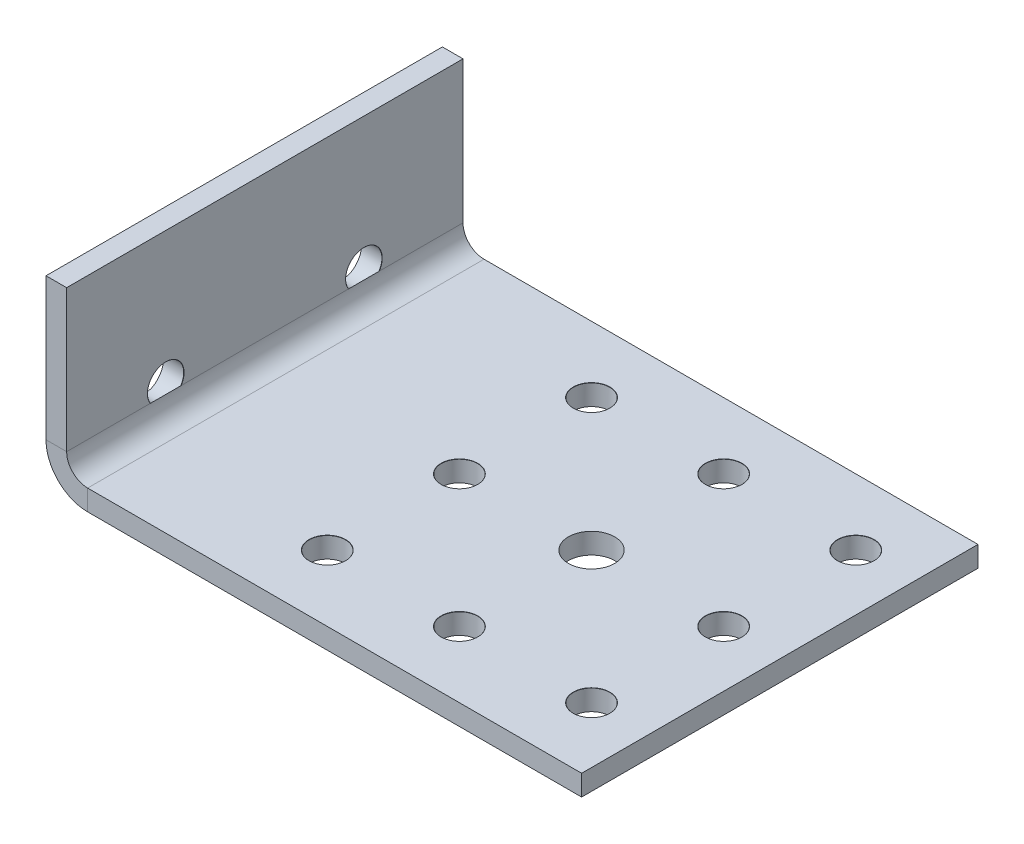
ISO-10303-21;
HEADER;
FILE_DESCRIPTION(('STEP AP214'),'2;1');
FILE_NAME('part.step','',(''),(''),'','','');
FILE_SCHEMA(('AUTOMOTIVE_DESIGN { 1 0 10303 214 1 1 1 1 }'));
ENDSEC;
DATA;
#1=APPLICATION_CONTEXT('core data for automotive mechanical design processes');
#2=APPLICATION_PROTOCOL_DEFINITION('international standard','automotive_design',2000,#1);
#3=PRODUCT_CONTEXT('',#1,'mechanical');
#4=PRODUCT('Part','Part','',(#3));
#5=PRODUCT_RELATED_PRODUCT_CATEGORY('part','',(#4));
#6=PRODUCT_DEFINITION_FORMATION('','',#4);
#7=PRODUCT_DEFINITION_CONTEXT('part definition',#1,'design');
#8=PRODUCT_DEFINITION('design','',#6,#7);
#9=PRODUCT_DEFINITION_SHAPE('','',#8);
#10=(LENGTH_UNIT() NAMED_UNIT(*) SI_UNIT(.MILLI.,.METRE.));
#11=(NAMED_UNIT(*) PLANE_ANGLE_UNIT() SI_UNIT($,.RADIAN.));
#12=(NAMED_UNIT(*) SI_UNIT($,.STERADIAN.) SOLID_ANGLE_UNIT());
#13=UNCERTAINTY_MEASURE_WITH_UNIT(LENGTH_MEASURE(1.E-05),#10,'distance_accuracy_value','');
#14=(GEOMETRIC_REPRESENTATION_CONTEXT(3) GLOBAL_UNCERTAINTY_ASSIGNED_CONTEXT((#13)) GLOBAL_UNIT_ASSIGNED_CONTEXT((#10,
#11,#12)) REPRESENTATION_CONTEXT('',''));
#15=CARTESIAN_POINT('',(0.,0.,0.));
#16=DIRECTION('',(0.,0.,1.));
#17=DIRECTION('',(1.,0.,0.));
#18=AXIS2_PLACEMENT_3D('',#15,#16,#17);
#19=CARTESIAN_POINT('',(0.544750789912651,77.6302492100876,30.));
#20=DIRECTION('',(0.,0.,-1.));
#21=DIRECTION('',(0.,-1.,0.));
#22=AXIS2_PLACEMENT_3D('',#19,#20,#21);
#23=PLANE('',#22);
#24=DIRECTION('',(-1.,0.,0.));
#25=VECTOR('',#24,1.);
#26=CARTESIAN_POINT('',(0.544750789912498,27.853833735717,30.));
#27=LINE('',#26,#25);
#28=CARTESIAN_POINT('',(-2.5802492100876,27.853833735717,30.));
#29=VERTEX_POINT('',#28);
#30=CARTESIAN_POINT('',(0.544750789912477,27.853833735717,30.));
#31=VERTEX_POINT('',#30);
#32=EDGE_CURVE('E428',#29,#31,#27,.F.);
#33=ORIENTED_EDGE('',*,*,#32,.F.);
#34=DIRECTION('',(0.,-1.,0.));
#35=VECTOR('',#34,1.);
#36=CARTESIAN_POINT('',(-2.58024921008761,2.63024921008761,30.));
#37=LINE('',#36,#35);
#38=CARTESIAN_POINT('',(-2.5802492100876,6.35500000000002,30.));
#39=VERTEX_POINT('',#38);
#40=EDGE_CURVE('E187',#29,#39,#37,.T.);
#41=ORIENTED_EDGE('',*,*,#40,.T.);
#42=DIRECTION('',(1.,0.,0.));
#43=VECTOR('',#42,1.);
#44=CARTESIAN_POINT('',(0.544750789912402,6.35500000000001,30.));
#45=LINE('',#44,#43);
#46=CARTESIAN_POINT('',(0.544750789912407,6.35500000000002,30.));
#47=VERTEX_POINT('',#46);
#48=EDGE_CURVE('E171',#39,#47,#45,.T.);
#49=ORIENTED_EDGE('',*,*,#48,.T.);
#50=DIRECTION('',(0.,-1.,0.));
#51=VECTOR('',#50,1.);
#52=CARTESIAN_POINT('',(0.544750789912651,77.6302492100876,30.));
#53=LINE('',#52,#51);
#54=EDGE_CURVE('E158',#31,#47,#53,.T.);
#55=ORIENTED_EDGE('',*,*,#54,.F.);
#56=EDGE_LOOP('',(#33,#41,#49,#55));
#57=FACE_BOUND('',#56,.T.);
#58=ADVANCED_FACE('F49',(#57),#23,.F.);
#59=CARTESIAN_POINT('',(0.544750789912651,77.6302492100876,-30.));
#60=DIRECTION('',(0.,0.,1.));
#61=DIRECTION('',(0.,1.,0.));
#62=AXIS2_PLACEMENT_3D('',#59,#60,#61);
#63=PLANE('',#62);
#64=DIRECTION('',(1.,0.,0.));
#65=VECTOR('',#64,1.);
#66=CARTESIAN_POINT('',(0.544750789912498,27.853833735717,-30.));
#67=LINE('',#66,#65);
#68=CARTESIAN_POINT('',(0.544750789912477,27.853833735717,-30.));
#69=VERTEX_POINT('',#68);
#70=CARTESIAN_POINT('',(-2.5802492100876,27.853833735717,-30.));
#71=VERTEX_POINT('',#70);
#72=EDGE_CURVE('E199',#69,#71,#67,.F.);
#73=ORIENTED_EDGE('',*,*,#72,.F.);
#74=DIRECTION('',(0.,1.,0.));
#75=VECTOR('',#74,1.);
#76=CARTESIAN_POINT('',(0.544750789912651,77.6302492100876,-30.));
#77=LINE('',#76,#75);
#78=CARTESIAN_POINT('',(0.544750789912402,6.35500000000001,-30.));
#79=VERTEX_POINT('',#78);
#80=EDGE_CURVE('E191',#79,#69,#77,.T.);
#81=ORIENTED_EDGE('',*,*,#80,.F.);
#82=DIRECTION('',(-1.,0.,0.));
#83=VECTOR('',#82,1.);
#84=CARTESIAN_POINT('',(0.544750789912402,6.35500000000001,-30.));
#85=LINE('',#84,#83);
#86=CARTESIAN_POINT('',(-2.5802492100876,6.35500000000002,-30.));
#87=VERTEX_POINT('',#86);
#88=EDGE_CURVE('E179',#79,#87,#85,.T.);
#89=ORIENTED_EDGE('',*,*,#88,.T.);
#90=DIRECTION('',(0.,-1.,0.));
#91=VECTOR('',#90,1.);
#92=CARTESIAN_POINT('',(-2.58024921008761,2.63024921008761,-30.));
#93=LINE('',#92,#91);
#94=EDGE_CURVE('E184',#87,#71,#93,.F.);
#95=ORIENTED_EDGE('',*,*,#94,.T.);
#96=EDGE_LOOP('',(#73,#81,#89,#95));
#97=FACE_BOUND('',#96,.T.);
#98=ADVANCED_FACE('F51',(#97),#63,.F.);
#99=CARTESIAN_POINT('',(-2.58024921008761,2.63024921008761,0.));
#100=DIRECTION('',(-1.,0.,0.));
#101=DIRECTION('',(0.,0.,-1.));
#102=AXIS2_PLACEMENT_3D('',#99,#100,#101);
#103=PLANE('',#102);
#104=CARTESIAN_POINT('',(-2.58024921008759,7.85383373571702,15.));
#105=DIRECTION('',(-1.,0.,0.));
#106=DIRECTION('',(0.,-1.,0.));
#107=AXIS2_PLACEMENT_3D('',#104,#105,#106);
#108=CIRCLE('',#107,2.74999999999999);
#109=CARTESIAN_POINT('',(-2.58024921008759,6.35500000000004,17.3056446891654));
#110=VERTEX_POINT('',#109);
#111=CARTESIAN_POINT('',(-2.5802492100876,6.35500000000002,12.6943553108346));
#112=VERTEX_POINT('',#111);
#113=EDGE_CURVE('E69',#110,#112,#108,.T.);
#114=ORIENTED_EDGE('',*,*,#113,.F.);
#115=DIRECTION('',(0.,0.,1.));
#116=VECTOR('',#115,1.);
#117=CARTESIAN_POINT('',(-2.5802492100876,6.35500000000002,0.));
#118=LINE('',#117,#116);
#119=EDGE_CURVE('E175',#110,#39,#118,.T.);
#120=ORIENTED_EDGE('',*,*,#119,.T.);
#121=ORIENTED_EDGE('',*,*,#40,.F.);
#122=DIRECTION('',(0.,0.,1.));
#123=VECTOR('',#122,1.);
#124=CARTESIAN_POINT('',(-2.58024921008752,27.853833735717,0.));
#125=LINE('',#124,#123);
#126=EDGE_CURVE('E386',#71,#29,#125,.T.);
#127=ORIENTED_EDGE('',*,*,#126,.F.);
#128=ORIENTED_EDGE('',*,*,#94,.F.);
#129=CARTESIAN_POINT('',(-2.5802492100876,6.35500000000002,-17.3056446891654));
#130=VERTEX_POINT('',#129);
#131=EDGE_CURVE('E176',#87,#130,#118,.T.);
#132=ORIENTED_EDGE('',*,*,#131,.T.);
#133=CARTESIAN_POINT('',(-2.58024921008759,7.85383373571702,-15.));
#134=DIRECTION('',(-1.,0.,0.));
#135=DIRECTION('',(0.,-1.,0.));
#136=AXIS2_PLACEMENT_3D('',#133,#134,#135);
#137=CIRCLE('',#136,2.74999999999999);
#138=CARTESIAN_POINT('',(-2.58024921008759,6.35500000000004,-12.6943553108346));
#139=VERTEX_POINT('',#138);
#140=EDGE_CURVE('E434',#139,#130,#137,.T.);
#141=ORIENTED_EDGE('',*,*,#140,.F.);
#142=EDGE_CURVE('E180',#139,#112,#118,.T.);
#143=ORIENTED_EDGE('',*,*,#142,.T.);
#144=EDGE_LOOP('',(#114,#120,#121,#127,#128,#132,#141,#143));
#145=FACE_BOUND('',#144,.T.);
#146=ADVANCED_FACE('F353',(#145),#103,.T.);
#147=CARTESIAN_POINT('',(0.544750789912389,2.6302492100876,0.));
#148=DIRECTION('',(-1.,0.,0.));
#149=DIRECTION('',(0.,0.,-1.));
#150=AXIS2_PLACEMENT_3D('',#147,#148,#149);
#151=PLANE('',#150);
#152=DIRECTION('',(0.,0.,1.));
#153=VECTOR('',#152,1.);
#154=CARTESIAN_POINT('',(0.544750789912402,6.355,0.));
#155=LINE('',#154,#153);
#156=CARTESIAN_POINT('',(0.544750789912409,6.355,17.3354062671571));
#157=VERTEX_POINT('',#156);
#158=EDGE_CURVE('E154',#157,#47,#155,.T.);
#159=ORIENTED_EDGE('',*,*,#158,.F.);
#160=CARTESIAN_POINT('',(0.544750789912409,7.85383373571702,15.));
#161=DIRECTION('',(1.,0.,0.));
#162=DIRECTION('',(0.,0.,-1.));
#163=AXIS2_PLACEMENT_3D('',#160,#161,#162);
#164=CIRCLE('',#163,2.775);
#165=CARTESIAN_POINT('',(0.544750789912402,6.355,12.6645937328429));
#166=VERTEX_POINT('',#165);
#167=EDGE_CURVE('E141',#166,#157,#164,.T.);
#168=ORIENTED_EDGE('',*,*,#167,.F.);
#169=CARTESIAN_POINT('',(0.544750789912409,6.355,-12.6645937328429));
#170=VERTEX_POINT('',#169);
#171=EDGE_CURVE('E166',#170,#166,#155,.T.);
#172=ORIENTED_EDGE('',*,*,#171,.F.);
#173=CARTESIAN_POINT('',(0.544750789912409,7.85383373571702,-15.));
#174=DIRECTION('',(1.,0.,0.));
#175=DIRECTION('',(0.,0.,-1.));
#176=AXIS2_PLACEMENT_3D('',#173,#174,#175);
#177=CIRCLE('',#176,2.775);
#178=CARTESIAN_POINT('',(0.544750789912402,6.355,-17.3354062671571));
#179=VERTEX_POINT('',#178);
#180=EDGE_CURVE('E368',#179,#170,#177,.T.);
#181=ORIENTED_EDGE('',*,*,#180,.F.);
#182=EDGE_CURVE('E163',#79,#179,#155,.T.);
#183=ORIENTED_EDGE('',*,*,#182,.F.);
#184=ORIENTED_EDGE('',*,*,#80,.T.);
#185=DIRECTION('',(0.,0.,1.));
#186=VECTOR('',#185,1.);
#187=CARTESIAN_POINT('',(0.544750789912477,27.853833735717,0.));
#188=LINE('',#187,#186);
#189=EDGE_CURVE('E183',#69,#31,#188,.T.);
#190=ORIENTED_EDGE('',*,*,#189,.T.);
#191=ORIENTED_EDGE('',*,*,#54,.T.);
#192=EDGE_LOOP('',(#159,#168,#172,#181,#183,#184,#190,#191));
#193=FACE_BOUND('',#192,.T.);
#194=ADVANCED_FACE('F155',(#193),#151,.F.);
#195=CARTESIAN_POINT('',(0.,3.175,0.));
#196=DIRECTION('',(0.,-1.,0.));
#197=DIRECTION('',(0.,0.,-1.));
#198=AXIS2_PLACEMENT_3D('',#195,#196,#197);
#199=PLANE('',#198);
#200=CARTESIAN_POINT('',(30.,3.175,-20.));
#201=DIRECTION('',(0.,1.,0.));
#202=DIRECTION('',(0.,0.,1.));
#203=AXIS2_PLACEMENT_3D('',#200,#201,#202);
#204=CIRCLE('',#203,2.775);
#205=CARTESIAN_POINT('',(30.,3.175,-17.225));
#206=VERTEX_POINT('',#205);
#207=EDGE_CURVE('E436',#206,#206,#204,.T.);
#208=ORIENTED_EDGE('',*,*,#207,.F.);
#209=EDGE_LOOP('',(#208));
#210=FACE_BOUND('',#209,.T.);
#211=CARTESIAN_POINT('',(70.,3.175,-20.));
#212=DIRECTION('',(0.,1.,0.));
#213=DIRECTION('',(0.,0.,1.));
#214=AXIS2_PLACEMENT_3D('',#211,#212,#213);
#215=CIRCLE('',#214,2.775);
#216=CARTESIAN_POINT('',(70.,3.175,-17.225));
#217=VERTEX_POINT('',#216);
#218=EDGE_CURVE('E238',#217,#217,#215,.T.);
#219=ORIENTED_EDGE('',*,*,#218,.F.);
#220=EDGE_LOOP('',(#219));
#221=FACE_BOUND('',#220,.T.);
#222=CARTESIAN_POINT('',(70.,3.175,20.));
#223=DIRECTION('',(0.,1.,0.));
#224=DIRECTION('',(0.,0.,1.));
#225=AXIS2_PLACEMENT_3D('',#222,#223,#224);
#226=CIRCLE('',#225,2.775);
#227=CARTESIAN_POINT('',(70.,3.175,22.775));
#228=VERTEX_POINT('',#227);
#229=EDGE_CURVE('E234',#228,#228,#226,.T.);
#230=ORIENTED_EDGE('',*,*,#229,.F.);
#231=EDGE_LOOP('',(#230));
#232=FACE_BOUND('',#231,.T.);
#233=CARTESIAN_POINT('',(30.,3.175,20.));
#234=DIRECTION('',(0.,1.,0.));
#235=DIRECTION('',(0.,0.,1.));
#236=AXIS2_PLACEMENT_3D('',#233,#234,#235);
#237=CIRCLE('',#236,2.775);
#238=CARTESIAN_POINT('',(30.,3.175,22.775));
#239=VERTEX_POINT('',#238);
#240=EDGE_CURVE('E229',#239,#239,#237,.T.);
#241=ORIENTED_EDGE('',*,*,#240,.F.);
#242=EDGE_LOOP('',(#241));
#243=FACE_BOUND('',#242,.T.);
#244=CARTESIAN_POINT('',(50.,3.175,-20.));
#245=DIRECTION('',(0.,1.,0.));
#246=DIRECTION('',(0.,0.,1.));
#247=AXIS2_PLACEMENT_3D('',#244,#245,#246);
#248=CIRCLE('',#247,2.775);
#249=CARTESIAN_POINT('',(50.,3.175,-17.225));
#250=VERTEX_POINT('',#249);
#251=EDGE_CURVE('E224',#250,#250,#248,.T.);
#252=ORIENTED_EDGE('',*,*,#251,.F.);
#253=EDGE_LOOP('',(#252));
#254=FACE_BOUND('',#253,.T.);
#255=CARTESIAN_POINT('',(50.,3.175,20.));
#256=DIRECTION('',(0.,1.,0.));
#257=DIRECTION('',(0.,0.,1.));
#258=AXIS2_PLACEMENT_3D('',#255,#256,#257);
#259=CIRCLE('',#258,2.775);
#260=CARTESIAN_POINT('',(50.,3.175,22.775));
#261=VERTEX_POINT('',#260);
#262=EDGE_CURVE('E219',#261,#261,#259,.T.);
#263=ORIENTED_EDGE('',*,*,#262,.F.);
#264=EDGE_LOOP('',(#263));
#265=FACE_BOUND('',#264,.T.);
#266=CARTESIAN_POINT('',(70.,3.175,0.));
#267=DIRECTION('',(0.,1.,0.));
#268=DIRECTION('',(0.,0.,1.));
#269=AXIS2_PLACEMENT_3D('',#266,#267,#268);
#270=CIRCLE('',#269,2.775);
#271=CARTESIAN_POINT('',(70.,3.175,2.775));
#272=VERTEX_POINT('',#271);
#273=EDGE_CURVE('E214',#272,#272,#270,.T.);
#274=ORIENTED_EDGE('',*,*,#273,.F.);
#275=EDGE_LOOP('',(#274));
#276=FACE_BOUND('',#275,.T.);
#277=CARTESIAN_POINT('',(30.,3.175,0.));
#278=DIRECTION('',(0.,1.,0.));
#279=DIRECTION('',(0.,0.,1.));
#280=AXIS2_PLACEMENT_3D('',#277,#278,#279);
#281=CIRCLE('',#280,2.775);
#282=CARTESIAN_POINT('',(30.,3.175,2.775));
#283=VERTEX_POINT('',#282);
#284=EDGE_CURVE('E209',#283,#283,#281,.T.);
#285=ORIENTED_EDGE('',*,*,#284,.F.);
#286=EDGE_LOOP('',(#285));
#287=FACE_BOUND('',#286,.T.);
#288=CARTESIAN_POINT('',(50.,3.175,0.));
#289=DIRECTION('',(0.,1.,0.));
#290=DIRECTION('',(0.,0.,1.));
#291=AXIS2_PLACEMENT_3D('',#288,#289,#290);
#292=CIRCLE('',#291,3.5);
#293=CARTESIAN_POINT('',(50.,3.175,3.5));
#294=VERTEX_POINT('',#293);
#295=EDGE_CURVE('E200',#294,#294,#292,.T.);
#296=ORIENTED_EDGE('',*,*,#295,.F.);
#297=EDGE_LOOP('',(#296));
#298=FACE_BOUND('',#297,.T.);
#299=DIRECTION('',(-1.,0.,0.));
#300=VECTOR('',#299,1.);
#301=CARTESIAN_POINT('',(-75.,3.175,-30.));
#302=LINE('',#301,#300);
#303=CARTESIAN_POINT('',(78.5,3.175,-30.));
#304=VERTEX_POINT('',#303);
#305=CARTESIAN_POINT('',(3.72475078991241,3.175,-30.));
#306=VERTEX_POINT('',#305);
#307=EDGE_CURVE('E398',#304,#306,#302,.T.);
#308=ORIENTED_EDGE('',*,*,#307,.T.);
#309=DIRECTION('',(0.,0.,1.));
#310=VECTOR('',#309,1.);
#311=CARTESIAN_POINT('',(3.72475078991241,3.175,0.));
#312=LINE('',#311,#310);
#313=CARTESIAN_POINT('',(3.72475078991241,3.175,30.));
#314=VERTEX_POINT('',#313);
#315=EDGE_CURVE('E395',#306,#314,#312,.T.);
#316=ORIENTED_EDGE('',*,*,#315,.T.);
#317=DIRECTION('',(1.,0.,0.));
#318=VECTOR('',#317,1.);
#319=CARTESIAN_POINT('',(-75.,3.175,30.));
#320=LINE('',#319,#318);
#321=CARTESIAN_POINT('',(78.5,3.175,30.));
#322=VERTEX_POINT('',#321);
#323=EDGE_CURVE('E393',#314,#322,#320,.T.);
#324=ORIENTED_EDGE('',*,*,#323,.T.);
#325=DIRECTION('',(0.,0.,1.));
#326=VECTOR('',#325,1.);
#327=CARTESIAN_POINT('',(78.5,3.175,30.));
#328=LINE('',#327,#326);
#329=EDGE_CURVE('E416',#304,#322,#328,.T.);
#330=ORIENTED_EDGE('',*,*,#329,.F.);
#331=EDGE_LOOP('',(#308,#316,#324,#330));
#332=FACE_BOUND('',#331,.T.);
#333=ADVANCED_FACE('F362',(#210,#221,#232,#243,#254,#265,#276,#287,#298,#332),#199,.F.);
#334=CARTESIAN_POINT('',(-75.,3.175,30.));
#335=DIRECTION('',(0.,0.,-1.));
#336=DIRECTION('',(1.,0.,0.));
#337=AXIS2_PLACEMENT_3D('',#334,#335,#336);
#338=PLANE('',#337);
#339=DIRECTION('',(0.,1.,0.));
#340=VECTOR('',#339,1.);
#341=CARTESIAN_POINT('',(3.72475078991241,3.175,30.));
#342=LINE('',#341,#340);
#343=CARTESIAN_POINT('',(3.72475078991241,0.0499999999999997,30.));
#344=VERTEX_POINT('',#343);
#345=EDGE_CURVE('E400',#344,#314,#342,.T.);
#346=ORIENTED_EDGE('',*,*,#345,.F.);
#347=DIRECTION('',(1.,0.,0.));
#348=VECTOR('',#347,1.);
#349=CARTESIAN_POINT('',(0.,0.0499999999999997,30.));
#350=LINE('',#349,#348);
#351=CARTESIAN_POINT('',(78.5,0.0499999999999997,30.));
#352=VERTEX_POINT('',#351);
#353=EDGE_CURVE('E391',#344,#352,#350,.T.);
#354=ORIENTED_EDGE('',*,*,#353,.T.);
#355=DIRECTION('',(0.,-1.,0.));
#356=VECTOR('',#355,1.);
#357=CARTESIAN_POINT('',(78.5,0.0499999999999997,30.));
#358=LINE('',#357,#356);
#359=EDGE_CURVE('E204',#322,#352,#358,.T.);
#360=ORIENTED_EDGE('',*,*,#359,.F.);
#361=ORIENTED_EDGE('',*,*,#323,.F.);
#362=EDGE_LOOP('',(#346,#354,#360,#361));
#363=FACE_BOUND('',#362,.T.);
#364=ADVANCED_FACE('F409',(#363),#338,.F.);
#365=CARTESIAN_POINT('',(0.,0.0499999999999997,0.));
#366=DIRECTION('',(0.,-1.,0.));
#367=DIRECTION('',(0.,0.,-1.));
#368=AXIS2_PLACEMENT_3D('',#365,#366,#367);
#369=PLANE('',#368);
#370=CARTESIAN_POINT('',(30.,0.0499999999999997,-20.));
#371=DIRECTION('',(0.,-1.,0.));
#372=DIRECTION('',(0.,0.,-1.));
#373=AXIS2_PLACEMENT_3D('',#370,#371,#372);
#374=CIRCLE('',#373,2.74999999999999);
#375=CARTESIAN_POINT('',(30.,0.0499999999999997,-22.75));
#376=VERTEX_POINT('',#375);
#377=EDGE_CURVE('E236',#376,#376,#374,.T.);
#378=ORIENTED_EDGE('',*,*,#377,.F.);
#379=EDGE_LOOP('',(#378));
#380=FACE_BOUND('',#379,.T.);
#381=CARTESIAN_POINT('',(70.,0.0499999999999997,-20.));
#382=DIRECTION('',(0.,-1.,0.));
#383=DIRECTION('',(0.,0.,-1.));
#384=AXIS2_PLACEMENT_3D('',#381,#382,#383);
#385=CIRCLE('',#384,2.74999999999999);
#386=CARTESIAN_POINT('',(70.,0.0499999999999997,-22.75));
#387=VERTEX_POINT('',#386);
#388=EDGE_CURVE('E231',#387,#387,#385,.T.);
#389=ORIENTED_EDGE('',*,*,#388,.F.);
#390=EDGE_LOOP('',(#389));
#391=FACE_BOUND('',#390,.T.);
#392=CARTESIAN_POINT('',(70.,0.0499999999999997,20.));
#393=DIRECTION('',(0.,-1.,0.));
#394=DIRECTION('',(0.,0.,-1.));
#395=AXIS2_PLACEMENT_3D('',#392,#393,#394);
#396=CIRCLE('',#395,2.74999999999999);
#397=CARTESIAN_POINT('',(70.,0.0499999999999997,17.25));
#398=VERTEX_POINT('',#397);
#399=EDGE_CURVE('E226',#398,#398,#396,.T.);
#400=ORIENTED_EDGE('',*,*,#399,.F.);
#401=EDGE_LOOP('',(#400));
#402=FACE_BOUND('',#401,.T.);
#403=CARTESIAN_POINT('',(30.,0.0499999999999997,20.));
#404=DIRECTION('',(0.,-1.,0.));
#405=DIRECTION('',(0.,0.,-1.));
#406=AXIS2_PLACEMENT_3D('',#403,#404,#405);
#407=CIRCLE('',#406,2.74999999999999);
#408=CARTESIAN_POINT('',(30.,0.0499999999999997,17.25));
#409=VERTEX_POINT('',#408);
#410=EDGE_CURVE('E221',#409,#409,#407,.T.);
#411=ORIENTED_EDGE('',*,*,#410,.F.);
#412=EDGE_LOOP('',(#411));
#413=FACE_BOUND('',#412,.T.);
#414=CARTESIAN_POINT('',(50.,0.0499999999999997,-20.));
#415=DIRECTION('',(0.,-1.,0.));
#416=DIRECTION('',(0.,0.,-1.));
#417=AXIS2_PLACEMENT_3D('',#414,#415,#416);
#418=CIRCLE('',#417,2.74999999999999);
#419=CARTESIAN_POINT('',(50.,0.0499999999999997,-22.75));
#420=VERTEX_POINT('',#419);
#421=EDGE_CURVE('E216',#420,#420,#418,.T.);
#422=ORIENTED_EDGE('',*,*,#421,.F.);
#423=EDGE_LOOP('',(#422));
#424=FACE_BOUND('',#423,.T.);
#425=CARTESIAN_POINT('',(50.,0.0499999999999997,20.));
#426=DIRECTION('',(0.,-1.,0.));
#427=DIRECTION('',(0.,0.,-1.));
#428=AXIS2_PLACEMENT_3D('',#425,#426,#427);
#429=CIRCLE('',#428,2.74999999999999);
#430=CARTESIAN_POINT('',(50.,0.0499999999999997,17.25));
#431=VERTEX_POINT('',#430);
#432=EDGE_CURVE('E211',#431,#431,#429,.T.);
#433=ORIENTED_EDGE('',*,*,#432,.F.);
#434=EDGE_LOOP('',(#433));
#435=FACE_BOUND('',#434,.T.);
#436=CARTESIAN_POINT('',(70.,0.0499999999999997,0.));
#437=DIRECTION('',(0.,-1.,0.));
#438=DIRECTION('',(0.,0.,-1.));
#439=AXIS2_PLACEMENT_3D('',#436,#437,#438);
#440=CIRCLE('',#439,2.74999999999999);
#441=CARTESIAN_POINT('',(70.,0.0499999999999997,-2.74999999999999));
#442=VERTEX_POINT('',#441);
#443=EDGE_CURVE('E206',#442,#442,#440,.T.);
#444=ORIENTED_EDGE('',*,*,#443,.F.);
#445=EDGE_LOOP('',(#444));
#446=FACE_BOUND('',#445,.T.);
#447=CARTESIAN_POINT('',(30.,0.0499999999999997,0.));
#448=DIRECTION('',(0.,-1.,0.));
#449=DIRECTION('',(0.,0.,-1.));
#450=AXIS2_PLACEMENT_3D('',#447,#448,#449);
#451=CIRCLE('',#450,2.74999999999999);
#452=CARTESIAN_POINT('',(30.,0.0499999999999997,-2.74999999999999));
#453=VERTEX_POINT('',#452);
#454=EDGE_CURVE('E201',#453,#453,#451,.T.);
#455=ORIENTED_EDGE('',*,*,#454,.F.);
#456=EDGE_LOOP('',(#455));
#457=FACE_BOUND('',#456,.T.);
#458=CARTESIAN_POINT('',(50.,0.0499999999999997,0.));
#459=DIRECTION('',(0.,-1.,0.));
#460=DIRECTION('',(0.,0.,-1.));
#461=AXIS2_PLACEMENT_3D('',#458,#459,#460);
#462=CIRCLE('',#461,3.5);
#463=CARTESIAN_POINT('',(50.,0.0499999999999997,-3.5));
#464=VERTEX_POINT('',#463);
#465=EDGE_CURVE('E196',#464,#464,#462,.T.);
#466=ORIENTED_EDGE('',*,*,#465,.F.);
#467=EDGE_LOOP('',(#466));
#468=FACE_BOUND('',#467,.T.);
#469=DIRECTION('',(0.,0.,1.));
#470=VECTOR('',#469,1.);
#471=CARTESIAN_POINT('',(3.72475078991241,0.0499999999999997,0.));
#472=LINE('',#471,#470);
#473=CARTESIAN_POINT('',(3.72475078991241,0.0499999999999997,-30.));
#474=VERTEX_POINT('',#473);
#475=EDGE_CURVE('E376',#474,#344,#472,.T.);
#476=ORIENTED_EDGE('',*,*,#475,.F.);
#477=DIRECTION('',(1.,0.,0.));
#478=VECTOR('',#477,1.);
#479=CARTESIAN_POINT('',(0.,0.0499999999999997,-30.));
#480=LINE('',#479,#478);
#481=CARTESIAN_POINT('',(78.5,0.0499999999999997,-30.));
#482=VERTEX_POINT('',#481);
#483=EDGE_CURVE('E188',#482,#474,#480,.F.);
#484=ORIENTED_EDGE('',*,*,#483,.F.);
#485=DIRECTION('',(0.,0.,-1.));
#486=VECTOR('',#485,1.);
#487=CARTESIAN_POINT('',(78.5,0.0499999999999997,30.));
#488=LINE('',#487,#486);
#489=EDGE_CURVE('E477',#352,#482,#488,.T.);
#490=ORIENTED_EDGE('',*,*,#489,.F.);
#491=ORIENTED_EDGE('',*,*,#353,.F.);
#492=EDGE_LOOP('',(#476,#484,#490,#491));
#493=FACE_BOUND('',#492,.T.);
#494=ADVANCED_FACE('F492',(#380,#391,#402,#413,#424,#435,#446,#457,#468,#493),#369,.T.);
#495=CARTESIAN_POINT('',(-75.,3.175,-30.));
#496=DIRECTION('',(0.,0.,1.));
#497=DIRECTION('',(-1.,0.,0.));
#498=AXIS2_PLACEMENT_3D('',#495,#496,#497);
#499=PLANE('',#498);
#500=DIRECTION('',(0.,-1.,0.));
#501=VECTOR('',#500,1.);
#502=CARTESIAN_POINT('',(3.72475078991241,3.175,-30.));
#503=LINE('',#502,#501);
#504=EDGE_CURVE('E172',#306,#474,#503,.T.);
#505=ORIENTED_EDGE('',*,*,#504,.F.);
#506=ORIENTED_EDGE('',*,*,#307,.F.);
#507=DIRECTION('',(0.,1.,0.));
#508=VECTOR('',#507,1.);
#509=CARTESIAN_POINT('',(78.5,0.0499999999999997,-30.));
#510=LINE('',#509,#508);
#511=EDGE_CURVE('E480',#482,#304,#510,.T.);
#512=ORIENTED_EDGE('',*,*,#511,.F.);
#513=ORIENTED_EDGE('',*,*,#483,.T.);
#514=EDGE_LOOP('',(#505,#506,#512,#513));
#515=FACE_BOUND('',#514,.T.);
#516=ADVANCED_FACE('F420',(#515),#499,.F.);
#517=CARTESIAN_POINT('',(3.72475078991241,6.355,-30.));
#518=DIRECTION('',(0.,0.,1.));
#519=DIRECTION('',(1.,0.,0.));
#520=AXIS2_PLACEMENT_3D('',#517,#518,#519);
#521=PLANE('',#520);
#522=ORIENTED_EDGE('',*,*,#504,.T.);
#523=CARTESIAN_POINT('',(3.72475078991241,6.355,-30.));
#524=DIRECTION('',(0.,0.,1.));
#525=DIRECTION('',(1.,0.,0.));
#526=AXIS2_PLACEMENT_3D('',#523,#524,#525);
#527=CIRCLE('',#526,6.305);
#528=EDGE_CURVE('E380',#474,#87,#527,.F.);
#529=ORIENTED_EDGE('',*,*,#528,.T.);
#530=ORIENTED_EDGE('',*,*,#88,.F.);
#531=CARTESIAN_POINT('',(3.72475078991241,6.355,-30.));
#532=DIRECTION('',(0.,0.,-1.));
#533=DIRECTION('',(-1.,0.,0.));
#534=AXIS2_PLACEMENT_3D('',#531,#532,#533);
#535=CIRCLE('',#534,3.18);
#536=EDGE_CURVE('E379',#306,#79,#535,.T.);
#537=ORIENTED_EDGE('',*,*,#536,.F.);
#538=EDGE_LOOP('',(#522,#529,#530,#537));
#539=FACE_BOUND('',#538,.T.);
#540=ADVANCED_FACE('F345',(#539),#521,.F.);
#541=CARTESIAN_POINT('',(3.72475078991241,6.355,30.));
#542=DIRECTION('',(0.,0.,-1.));
#543=DIRECTION('',(-1.,0.,0.));
#544=AXIS2_PLACEMENT_3D('',#541,#542,#543);
#545=PLANE('',#544);
#546=ORIENTED_EDGE('',*,*,#48,.F.);
#547=CARTESIAN_POINT('',(3.72475078991241,6.355,30.));
#548=DIRECTION('',(0.,0.,1.));
#549=DIRECTION('',(1.,0.,0.));
#550=AXIS2_PLACEMENT_3D('',#547,#548,#549);
#551=CIRCLE('',#550,6.305);
#552=EDGE_CURVE('E373',#39,#344,#551,.T.);
#553=ORIENTED_EDGE('',*,*,#552,.T.);
#554=ORIENTED_EDGE('',*,*,#345,.T.);
#555=CARTESIAN_POINT('',(3.72475078991241,6.355,30.));
#556=DIRECTION('',(0.,0.,1.));
#557=DIRECTION('',(1.,0.,0.));
#558=AXIS2_PLACEMENT_3D('',#555,#556,#557);
#559=CIRCLE('',#558,3.18);
#560=EDGE_CURVE('E383',#47,#314,#559,.T.);
#561=ORIENTED_EDGE('',*,*,#560,.F.);
#562=EDGE_LOOP('',(#546,#553,#554,#561));
#563=FACE_BOUND('',#562,.T.);
#564=ADVANCED_FACE('F338',(#563),#545,.F.);
#565=CARTESIAN_POINT('',(3.72475078991241,6.355,-60.5413965711711));
#566=DIRECTION('',(0.,0.,1.));
#567=DIRECTION('',(1.,0.,0.));
#568=AXIS2_PLACEMENT_3D('',#565,#566,#567);
#569=CYLINDRICAL_SURFACE('',#568,3.18);
#570=ORIENTED_EDGE('',*,*,#560,.T.);
#571=ORIENTED_EDGE('',*,*,#315,.F.);
#572=ORIENTED_EDGE('',*,*,#536,.T.);
#573=ORIENTED_EDGE('',*,*,#182,.T.);
#574=EDGE_CURVE('E167',#179,#170,#155,.T.);
#575=ORIENTED_EDGE('',*,*,#574,.T.);
#576=ORIENTED_EDGE('',*,*,#171,.T.);
#577=EDGE_CURVE('E151',#166,#157,#155,.T.);
#578=ORIENTED_EDGE('',*,*,#577,.T.);
#579=ORIENTED_EDGE('',*,*,#158,.T.);
#580=EDGE_LOOP('',(#570,#571,#572,#573,#575,#576,#578,#579));
#581=FACE_BOUND('',#580,.T.);
#582=ADVANCED_FACE('F164',(#581),#569,.F.);
#583=CARTESIAN_POINT('',(3.72475078991241,6.355,-60.5413965711711));
#584=DIRECTION('',(0.,0.,1.));
#585=DIRECTION('',(1.,0.,0.));
#586=AXIS2_PLACEMENT_3D('',#583,#584,#585);
#587=CYLINDRICAL_SURFACE('',#586,6.305);
#588=ORIENTED_EDGE('',*,*,#119,.F.);
#589=CARTESIAN_POINT('',(-2.58024921008759,6.35500000000004,17.3056446891654));
#590=CARTESIAN_POINT('',(-2.58025354382932,6.29062361073747,17.2638055769702));
#591=CARTESIAN_POINT('',(-2.57926328216914,6.22801950108544,17.2192634432795));
#592=CARTESIAN_POINT('',(-2.57565248921024,6.10679621120105,17.1251434228361));
#593=CARTESIAN_POINT('',(-2.57303243503339,6.04817587028928,17.0755670134207));
#594=CARTESIAN_POINT('',(-2.5665245330049,5.93539115203049,16.9717871656727));
#595=CARTESIAN_POINT('',(-2.56263823558417,5.88122142625779,16.917589445445));
#596=CARTESIAN_POINT('',(-2.55397277151328,5.77762946263299,16.8049210356371));
#597=CARTESIAN_POINT('',(-2.54919355534772,5.72820748829023,16.7464501092025));
#598=CARTESIAN_POINT('',(-2.53408533311173,5.587613284288,16.5652661096538));
#599=CARTESIAN_POINT('',(-2.52297506182522,5.50396036519395,16.4366412293523));
#600=CARTESIAN_POINT('',(-2.50154467198821,5.3591795243794,16.1673081766771));
#601=CARTESIAN_POINT('',(-2.49122456037712,5.29805180046381,16.0265998982066));
#602=CARTESIAN_POINT('',(-2.4736351223215,5.19931733698884,15.7348752446423));
#603=CARTESIAN_POINT('',(-2.46640735273219,5.16202785486781,15.5837483387071));
#604=CARTESIAN_POINT('',(-2.45685059572983,5.11344515747196,15.2772181871253));
#605=CARTESIAN_POINT('',(-2.45452137572665,5.10215070791338,15.1218151448708));
#606=CARTESIAN_POINT('',(-2.45527701564602,5.10588916490334,14.8141232689642));
#607=CARTESIAN_POINT('',(-2.45826602630816,5.12045596959184,14.6618283388167));
#608=CARTESIAN_POINT('',(-2.46881901620662,5.17454845927754,14.3619141194533));
#609=CARTESIAN_POINT('',(-2.47638301633196,5.21407425823543,14.2142948515894));
#610=CARTESIAN_POINT('',(-2.49442144038702,5.31691267423021,13.9277550415198));
#611=CARTESIAN_POINT('',(-2.50489653065725,5.38023073842079,13.7888364998178));
#612=CARTESIAN_POINT('',(-2.52634569182802,5.52889887682866,13.5234071046604));
#613=CARTESIAN_POINT('',(-2.53731973676717,5.61424780582367,13.3968956067257));
#614=CARTESIAN_POINT('',(-2.55649311221357,5.80061335560364,13.1648109688283));
#615=CARTESIAN_POINT('',(-2.56479371334867,5.90076985369596,13.0585591461425));
#616=CARTESIAN_POINT('',(-2.57370400391572,6.06272193007689,12.9119995928712));
#617=CARTESIAN_POINT('',(-2.57608447624293,6.11870768789872,12.8652509377026));
#618=CARTESIAN_POINT('',(-2.57935841837247,6.23425617596988,12.7763131381863));
#619=CARTESIAN_POINT('',(-2.5802514562742,6.29381993995128,12.7341253214756));
#620=CARTESIAN_POINT('',(-2.58024921008759,6.35500000000004,12.6943553108346));
#621=B_SPLINE_CURVE_WITH_KNOTS('',3,(#589,#590,#591,#592,#593,#594,#595,#596,#597,#598,#599,
#600,#601,#602,#603,#604,#605,#606,#607,#608,#609,#610,#611,#612,#613,#614,#615,#616,#617,#618,
#619,#620),.UNSPECIFIED.,.F.,.F.,(4,2,2,2,2,2,2,2,2,2,2,2,2,2,2,4),(0.,0.230239744027775,
0.460412117055585,0.690303711774247,0.92020805855579,1.37940161042662,1.83859919460757,
2.30378744950082,2.76895361609115,3.22582092289113,3.68269031572405,4.13966437095779,
4.5966146762605,5.03335066125195,5.25206429980805,5.47084143433462),.UNSPECIFIED.);
#622=EDGE_CURVE('E12',#110,#112,#621,.T.);
#623=ORIENTED_EDGE('',*,*,#622,.T.);
#624=ORIENTED_EDGE('',*,*,#142,.F.);
#625=CARTESIAN_POINT('',(-2.58024921008759,6.35500000000004,-12.6943553108346));
#626=CARTESIAN_POINT('',(-2.58025354382932,6.29062361073747,-12.7361944230298));
#627=CARTESIAN_POINT('',(-2.57926328216914,6.22801950108544,-12.7807365567205));
#628=CARTESIAN_POINT('',(-2.57565248921024,6.10679621120104,-12.8748565771639));
#629=CARTESIAN_POINT('',(-2.57303243503339,6.04817587028927,-12.9244329865793));
#630=CARTESIAN_POINT('',(-2.5665245330049,5.93539115203049,-13.0282128343273));
#631=CARTESIAN_POINT('',(-2.56263823558417,5.88122142625779,-13.082410554555));
#632=CARTESIAN_POINT('',(-2.55397277151328,5.77762946263299,-13.1950789643629));
#633=CARTESIAN_POINT('',(-2.54919355534772,5.72820748829023,-13.2535498907976));
#634=CARTESIAN_POINT('',(-2.53408533311172,5.58761328428799,-13.4347338903462));
#635=CARTESIAN_POINT('',(-2.52297506182522,5.50396036519395,-13.5633587706477));
#636=CARTESIAN_POINT('',(-2.50154467198821,5.3591795243794,-13.8326918233229));
#637=CARTESIAN_POINT('',(-2.49122456037712,5.29805180046381,-13.9734001017934));
#638=CARTESIAN_POINT('',(-2.4736351223215,5.19931733698883,-14.2651247553577));
#639=CARTESIAN_POINT('',(-2.46640735273219,5.16202785486781,-14.4162516612929));
#640=CARTESIAN_POINT('',(-2.45685059572983,5.11344515747196,-14.7227818128747));
#641=CARTESIAN_POINT('',(-2.45452137572665,5.10215070791338,-14.8781848551292));
#642=CARTESIAN_POINT('',(-2.45527701564602,5.10588916490334,-15.1858767310358));
#643=CARTESIAN_POINT('',(-2.45826602630816,5.12045596959184,-15.3381716611833));
#644=CARTESIAN_POINT('',(-2.46881901620662,5.17454845927754,-15.6380858805467));
#645=CARTESIAN_POINT('',(-2.47638301633196,5.21407425823543,-15.7857051484106));
#646=CARTESIAN_POINT('',(-2.49442144038702,5.31691267423022,-16.0722449584803));
#647=CARTESIAN_POINT('',(-2.50489653065725,5.38023073842079,-16.2111635001822));
#648=CARTESIAN_POINT('',(-2.52634569182802,5.52889887682867,-16.4765928953396));
#649=CARTESIAN_POINT('',(-2.53731973676717,5.61424780582367,-16.6031043932743));
#650=CARTESIAN_POINT('',(-2.55649311221357,5.80061335560364,-16.8351890311717));
#651=CARTESIAN_POINT('',(-2.56479371334867,5.90076985369596,-16.9414408538575));
#652=CARTESIAN_POINT('',(-2.57370400391572,6.06272193007689,-17.0880004071288));
#653=CARTESIAN_POINT('',(-2.57608447624293,6.11870768789871,-17.1347490622974));
#654=CARTESIAN_POINT('',(-2.57935841837247,6.23425617596987,-17.2236868618137));
#655=CARTESIAN_POINT('',(-2.5802514562742,6.29381993995127,-17.2658746785244));
#656=CARTESIAN_POINT('',(-2.58024921008759,6.35500000000004,-17.3056446891654));
#657=B_SPLINE_CURVE_WITH_KNOTS('',3,(#625,#626,#627,#628,#629,#630,#631,#632,#633,#634,#635,
#636,#637,#638,#639,#640,#641,#642,#643,#644,#645,#646,#647,#648,#649,#650,#651,#652,#653,#654,
#655,#656),.UNSPECIFIED.,.F.,.F.,(4,2,2,2,2,2,2,2,2,2,2,2,2,2,2,4),(0.,0.230239744027779,
0.46041211705559,0.690303711774251,0.920208058555792,1.37940161042662,1.83859919460758,
2.30378744950082,2.76895361609116,3.22582092289113,3.68269031572405,4.13966437095779,
4.59661467626051,5.03335066125194,5.25206429980804,5.47084143433462),.UNSPECIFIED.);
#658=EDGE_CURVE('E63',#139,#130,#657,.T.);
#659=ORIENTED_EDGE('',*,*,#658,.T.);
#660=ORIENTED_EDGE('',*,*,#131,.F.);
#661=ORIENTED_EDGE('',*,*,#528,.F.);
#662=ORIENTED_EDGE('',*,*,#475,.T.);
#663=ORIENTED_EDGE('',*,*,#552,.F.);
#664=EDGE_LOOP('',(#588,#623,#624,#659,#660,#661,#662,#663));
#665=FACE_BOUND('',#664,.T.);
#666=ADVANCED_FACE('F246',(#665),#587,.T.);
#667=CARTESIAN_POINT('',(0.,27.853833735717,0.));
#668=DIRECTION('',(0.,-1.,0.));
#669=DIRECTION('',(1.,0.,0.));
#670=AXIS2_PLACEMENT_3D('',#667,#668,#669);
#671=PLANE('',#670);
#672=ORIENTED_EDGE('',*,*,#126,.T.);
#673=ORIENTED_EDGE('',*,*,#32,.T.);
#674=ORIENTED_EDGE('',*,*,#189,.F.);
#675=ORIENTED_EDGE('',*,*,#72,.T.);
#676=EDGE_LOOP('',(#672,#673,#674,#675));
#677=FACE_BOUND('',#676,.T.);
#678=ADVANCED_FACE('F333',(#677),#671,.F.);
#679=CARTESIAN_POINT('',(50.,-6.825,0.));
#680=DIRECTION('',(0.,1.,0.));
#681=DIRECTION('',(0.,0.,1.));
#682=AXIS2_PLACEMENT_3D('',#679,#680,#681);
#683=CYLINDRICAL_SURFACE('',#682,3.5);
#684=ORIENTED_EDGE('',*,*,#465,.T.);
#685=EDGE_LOOP('',(#684));
#686=FACE_BOUND('',#685,.T.);
#687=ORIENTED_EDGE('',*,*,#295,.T.);
#688=EDGE_LOOP('',(#687));
#689=FACE_BOUND('',#688,.T.);
#690=ADVANCED_FACE('F329',(#686,#689),#683,.F.);
#691=CARTESIAN_POINT('',(78.5,0.,0.));
#692=DIRECTION('',(-1.,0.,0.));
#693=DIRECTION('',(0.,0.,1.));
#694=AXIS2_PLACEMENT_3D('',#691,#692,#693);
#695=PLANE('',#694);
#696=ORIENTED_EDGE('',*,*,#359,.T.);
#697=ORIENTED_EDGE('',*,*,#489,.T.);
#698=ORIENTED_EDGE('',*,*,#511,.T.);
#699=ORIENTED_EDGE('',*,*,#329,.T.);
#700=EDGE_LOOP('',(#696,#697,#698,#699));
#701=FACE_BOUND('',#700,.T.);
#702=ADVANCED_FACE('F325',(#701),#695,.F.);
#703=CARTESIAN_POINT('',(30.,3.175,0.));
#704=DIRECTION('',(0.,1.,0.));
#705=DIRECTION('',(0.,0.,1.));
#706=AXIS2_PLACEMENT_3D('',#703,#704,#705);
#707=CYLINDRICAL_SURFACE('',#706,2.74999999999999);
#708=ORIENTED_EDGE('',*,*,#454,.T.);
#709=EDGE_LOOP('',(#708));
#710=FACE_BOUND('',#709,.T.);
#711=CARTESIAN_POINT('',(30.,3.14999999999999,0.));
#712=DIRECTION('',(0.,1.,0.));
#713=DIRECTION('',(0.,0.,1.));
#714=AXIS2_PLACEMENT_3D('',#711,#712,#713);
#715=CIRCLE('',#714,2.74999999999999);
#716=CARTESIAN_POINT('',(30.,3.14999999999999,2.74999999999999));
#717=VERTEX_POINT('',#716);
#718=EDGE_CURVE('E205',#717,#717,#715,.T.);
#719=ORIENTED_EDGE('',*,*,#718,.T.);
#720=EDGE_LOOP('',(#719));
#721=FACE_BOUND('',#720,.T.);
#722=ADVANCED_FACE('F321',(#710,#721),#707,.F.);
#723=CARTESIAN_POINT('',(30.,3.175,0.));
#724=DIRECTION('',(0.,1.,0.));
#725=DIRECTION('',(0.,0.,1.));
#726=AXIS2_PLACEMENT_3D('',#723,#724,#725);
#727=CONICAL_SURFACE('',#726,2.775,0.785398163397275);
#728=ORIENTED_EDGE('',*,*,#718,.F.);
#729=EDGE_LOOP('',(#728));
#730=FACE_BOUND('',#729,.T.);
#731=ORIENTED_EDGE('',*,*,#284,.T.);
#732=EDGE_LOOP('',(#731));
#733=FACE_BOUND('',#732,.T.);
#734=ADVANCED_FACE('F317',(#730,#733),#727,.F.);
#735=CARTESIAN_POINT('',(70.,3.175,0.));
#736=DIRECTION('',(0.,1.,0.));
#737=DIRECTION('',(0.,0.,1.));
#738=AXIS2_PLACEMENT_3D('',#735,#736,#737);
#739=CYLINDRICAL_SURFACE('',#738,2.74999999999999);
#740=ORIENTED_EDGE('',*,*,#443,.T.);
#741=EDGE_LOOP('',(#740));
#742=FACE_BOUND('',#741,.T.);
#743=CARTESIAN_POINT('',(70.,3.14999999999999,0.));
#744=DIRECTION('',(0.,1.,0.));
#745=DIRECTION('',(0.,0.,1.));
#746=AXIS2_PLACEMENT_3D('',#743,#744,#745);
#747=CIRCLE('',#746,2.74999999999999);
#748=CARTESIAN_POINT('',(70.,3.14999999999999,2.74999999999999));
#749=VERTEX_POINT('',#748);
#750=EDGE_CURVE('E210',#749,#749,#747,.T.);
#751=ORIENTED_EDGE('',*,*,#750,.T.);
#752=EDGE_LOOP('',(#751));
#753=FACE_BOUND('',#752,.T.);
#754=ADVANCED_FACE('F313',(#742,#753),#739,.F.);
#755=CARTESIAN_POINT('',(70.,3.175,0.));
#756=DIRECTION('',(0.,1.,0.));
#757=DIRECTION('',(0.,0.,1.));
#758=AXIS2_PLACEMENT_3D('',#755,#756,#757);
#759=CONICAL_SURFACE('',#758,2.775,0.785398163397414);
#760=ORIENTED_EDGE('',*,*,#750,.F.);
#761=EDGE_LOOP('',(#760));
#762=FACE_BOUND('',#761,.T.);
#763=ORIENTED_EDGE('',*,*,#273,.T.);
#764=EDGE_LOOP('',(#763));
#765=FACE_BOUND('',#764,.T.);
#766=ADVANCED_FACE('F309',(#762,#765),#759,.F.);
#767=CARTESIAN_POINT('',(50.,3.175,20.));
#768=DIRECTION('',(0.,1.,0.));
#769=DIRECTION('',(0.,0.,1.));
#770=AXIS2_PLACEMENT_3D('',#767,#768,#769);
#771=CYLINDRICAL_SURFACE('',#770,2.74999999999999);
#772=ORIENTED_EDGE('',*,*,#432,.T.);
#773=EDGE_LOOP('',(#772));
#774=FACE_BOUND('',#773,.T.);
#775=CARTESIAN_POINT('',(50.,3.14999999999999,20.));
#776=DIRECTION('',(0.,1.,0.));
#777=DIRECTION('',(0.,0.,1.));
#778=AXIS2_PLACEMENT_3D('',#775,#776,#777);
#779=CIRCLE('',#778,2.74999999999999);
#780=CARTESIAN_POINT('',(50.,3.14999999999999,22.75));
#781=VERTEX_POINT('',#780);
#782=EDGE_CURVE('E215',#781,#781,#779,.T.);
#783=ORIENTED_EDGE('',*,*,#782,.T.);
#784=EDGE_LOOP('',(#783));
#785=FACE_BOUND('',#784,.T.);
#786=ADVANCED_FACE('F305',(#774,#785),#771,.F.);
#787=CARTESIAN_POINT('',(50.,3.175,20.));
#788=DIRECTION('',(0.,1.,0.));
#789=DIRECTION('',(0.,0.,1.));
#790=AXIS2_PLACEMENT_3D('',#787,#788,#789);
#791=CONICAL_SURFACE('',#790,2.775,0.785398163397414);
#792=ORIENTED_EDGE('',*,*,#782,.F.);
#793=EDGE_LOOP('',(#792));
#794=FACE_BOUND('',#793,.T.);
#795=ORIENTED_EDGE('',*,*,#262,.T.);
#796=EDGE_LOOP('',(#795));
#797=FACE_BOUND('',#796,.T.);
#798=ADVANCED_FACE('F301',(#794,#797),#791,.F.);
#799=CARTESIAN_POINT('',(50.,3.175,-20.));
#800=DIRECTION('',(0.,1.,0.));
#801=DIRECTION('',(0.,0.,1.));
#802=AXIS2_PLACEMENT_3D('',#799,#800,#801);
#803=CYLINDRICAL_SURFACE('',#802,2.74999999999999);
#804=ORIENTED_EDGE('',*,*,#421,.T.);
#805=EDGE_LOOP('',(#804));
#806=FACE_BOUND('',#805,.T.);
#807=CARTESIAN_POINT('',(50.,3.14999999999999,-20.));
#808=DIRECTION('',(0.,1.,0.));
#809=DIRECTION('',(0.,0.,1.));
#810=AXIS2_PLACEMENT_3D('',#807,#808,#809);
#811=CIRCLE('',#810,2.74999999999999);
#812=CARTESIAN_POINT('',(50.,3.14999999999999,-17.25));
#813=VERTEX_POINT('',#812);
#814=EDGE_CURVE('E220',#813,#813,#811,.T.);
#815=ORIENTED_EDGE('',*,*,#814,.T.);
#816=EDGE_LOOP('',(#815));
#817=FACE_BOUND('',#816,.T.);
#818=ADVANCED_FACE('F297',(#806,#817),#803,.F.);
#819=CARTESIAN_POINT('',(50.,3.175,-20.));
#820=DIRECTION('',(0.,1.,0.));
#821=DIRECTION('',(0.,0.,1.));
#822=AXIS2_PLACEMENT_3D('',#819,#820,#821);
#823=CONICAL_SURFACE('',#822,2.775,0.785398163397414);
#824=ORIENTED_EDGE('',*,*,#814,.F.);
#825=EDGE_LOOP('',(#824));
#826=FACE_BOUND('',#825,.T.);
#827=ORIENTED_EDGE('',*,*,#251,.T.);
#828=EDGE_LOOP('',(#827));
#829=FACE_BOUND('',#828,.T.);
#830=ADVANCED_FACE('F293',(#826,#829),#823,.F.);
#831=CARTESIAN_POINT('',(30.,3.175,20.));
#832=DIRECTION('',(0.,1.,0.));
#833=DIRECTION('',(0.,0.,1.));
#834=AXIS2_PLACEMENT_3D('',#831,#832,#833);
#835=CYLINDRICAL_SURFACE('',#834,2.74999999999999);
#836=ORIENTED_EDGE('',*,*,#410,.T.);
#837=EDGE_LOOP('',(#836));
#838=FACE_BOUND('',#837,.T.);
#839=CARTESIAN_POINT('',(30.,3.14999999999999,20.));
#840=DIRECTION('',(0.,1.,0.));
#841=DIRECTION('',(0.,0.,1.));
#842=AXIS2_PLACEMENT_3D('',#839,#840,#841);
#843=CIRCLE('',#842,2.74999999999999);
#844=CARTESIAN_POINT('',(30.,3.14999999999999,22.75));
#845=VERTEX_POINT('',#844);
#846=EDGE_CURVE('E225',#845,#845,#843,.T.);
#847=ORIENTED_EDGE('',*,*,#846,.T.);
#848=EDGE_LOOP('',(#847));
#849=FACE_BOUND('',#848,.T.);
#850=ADVANCED_FACE('F289',(#838,#849),#835,.F.);
#851=CARTESIAN_POINT('',(30.,3.175,20.));
#852=DIRECTION('',(0.,1.,0.));
#853=DIRECTION('',(0.,0.,1.));
#854=AXIS2_PLACEMENT_3D('',#851,#852,#853);
#855=CONICAL_SURFACE('',#854,2.775,0.785398163397275);
#856=ORIENTED_EDGE('',*,*,#846,.F.);
#857=EDGE_LOOP('',(#856));
#858=FACE_BOUND('',#857,.T.);
#859=ORIENTED_EDGE('',*,*,#240,.T.);
#860=EDGE_LOOP('',(#859));
#861=FACE_BOUND('',#860,.T.);
#862=ADVANCED_FACE('F285',(#858,#861),#855,.F.);
#863=CARTESIAN_POINT('',(70.,3.175,20.));
#864=DIRECTION('',(0.,1.,0.));
#865=DIRECTION('',(0.,0.,1.));
#866=AXIS2_PLACEMENT_3D('',#863,#864,#865);
#867=CYLINDRICAL_SURFACE('',#866,2.74999999999999);
#868=ORIENTED_EDGE('',*,*,#399,.T.);
#869=EDGE_LOOP('',(#868));
#870=FACE_BOUND('',#869,.T.);
#871=CARTESIAN_POINT('',(70.,3.14999999999999,20.));
#872=DIRECTION('',(0.,1.,0.));
#873=DIRECTION('',(0.,0.,1.));
#874=AXIS2_PLACEMENT_3D('',#871,#872,#873);
#875=CIRCLE('',#874,2.74999999999999);
#876=CARTESIAN_POINT('',(70.,3.14999999999999,22.75));
#877=VERTEX_POINT('',#876);
#878=EDGE_CURVE('E230',#877,#877,#875,.T.);
#879=ORIENTED_EDGE('',*,*,#878,.T.);
#880=EDGE_LOOP('',(#879));
#881=FACE_BOUND('',#880,.T.);
#882=ADVANCED_FACE('F281',(#870,#881),#867,.F.);
#883=CARTESIAN_POINT('',(70.,3.175,20.));
#884=DIRECTION('',(0.,1.,0.));
#885=DIRECTION('',(0.,0.,1.));
#886=AXIS2_PLACEMENT_3D('',#883,#884,#885);
#887=CONICAL_SURFACE('',#886,2.775,0.785398163397414);
#888=ORIENTED_EDGE('',*,*,#878,.F.);
#889=EDGE_LOOP('',(#888));
#890=FACE_BOUND('',#889,.T.);
#891=ORIENTED_EDGE('',*,*,#229,.T.);
#892=EDGE_LOOP('',(#891));
#893=FACE_BOUND('',#892,.T.);
#894=ADVANCED_FACE('F277',(#890,#893),#887,.F.);
#895=CARTESIAN_POINT('',(70.,3.175,-20.));
#896=DIRECTION('',(0.,1.,0.));
#897=DIRECTION('',(0.,0.,1.));
#898=AXIS2_PLACEMENT_3D('',#895,#896,#897);
#899=CYLINDRICAL_SURFACE('',#898,2.74999999999999);
#900=ORIENTED_EDGE('',*,*,#388,.T.);
#901=EDGE_LOOP('',(#900));
#902=FACE_BOUND('',#901,.T.);
#903=CARTESIAN_POINT('',(70.,3.14999999999999,-20.));
#904=DIRECTION('',(0.,1.,0.));
#905=DIRECTION('',(0.,0.,1.));
#906=AXIS2_PLACEMENT_3D('',#903,#904,#905);
#907=CIRCLE('',#906,2.74999999999999);
#908=CARTESIAN_POINT('',(70.,3.14999999999999,-17.25));
#909=VERTEX_POINT('',#908);
#910=EDGE_CURVE('E235',#909,#909,#907,.T.);
#911=ORIENTED_EDGE('',*,*,#910,.T.);
#912=EDGE_LOOP('',(#911));
#913=FACE_BOUND('',#912,.T.);
#914=ADVANCED_FACE('F273',(#902,#913),#899,.F.);
#915=CARTESIAN_POINT('',(70.,3.175,-20.));
#916=DIRECTION('',(0.,1.,0.));
#917=DIRECTION('',(0.,0.,1.));
#918=AXIS2_PLACEMENT_3D('',#915,#916,#917);
#919=CONICAL_SURFACE('',#918,2.775,0.785398163397414);
#920=ORIENTED_EDGE('',*,*,#910,.F.);
#921=EDGE_LOOP('',(#920));
#922=FACE_BOUND('',#921,.T.);
#923=ORIENTED_EDGE('',*,*,#218,.T.);
#924=EDGE_LOOP('',(#923));
#925=FACE_BOUND('',#924,.T.);
#926=ADVANCED_FACE('F269',(#922,#925),#919,.F.);
#927=CARTESIAN_POINT('',(30.,3.175,-20.));
#928=DIRECTION('',(0.,1.,0.));
#929=DIRECTION('',(0.,0.,1.));
#930=AXIS2_PLACEMENT_3D('',#927,#928,#929);
#931=CYLINDRICAL_SURFACE('',#930,2.74999999999999);
#932=ORIENTED_EDGE('',*,*,#377,.T.);
#933=EDGE_LOOP('',(#932));
#934=FACE_BOUND('',#933,.T.);
#935=CARTESIAN_POINT('',(30.,3.14999999999999,-20.));
#936=DIRECTION('',(0.,1.,0.));
#937=DIRECTION('',(0.,0.,1.));
#938=AXIS2_PLACEMENT_3D('',#935,#936,#937);
#939=CIRCLE('',#938,2.74999999999999);
#940=CARTESIAN_POINT('',(30.,3.14999999999999,-17.25));
#941=VERTEX_POINT('',#940);
#942=EDGE_CURVE('E239',#941,#941,#939,.T.);
#943=ORIENTED_EDGE('',*,*,#942,.T.);
#944=EDGE_LOOP('',(#943));
#945=FACE_BOUND('',#944,.T.);
#946=ADVANCED_FACE('F265',(#934,#945),#931,.F.);
#947=CARTESIAN_POINT('',(30.,3.175,-20.));
#948=DIRECTION('',(0.,1.,0.));
#949=DIRECTION('',(0.,0.,1.));
#950=AXIS2_PLACEMENT_3D('',#947,#948,#949);
#951=CONICAL_SURFACE('',#950,2.775,0.785398163397275);
#952=ORIENTED_EDGE('',*,*,#942,.F.);
#953=EDGE_LOOP('',(#952));
#954=FACE_BOUND('',#953,.T.);
#955=ORIENTED_EDGE('',*,*,#207,.T.);
#956=EDGE_LOOP('',(#955));
#957=FACE_BOUND('',#956,.T.);
#958=ADVANCED_FACE('F261',(#954,#957),#951,.F.);
#959=CARTESIAN_POINT('',(0.544750789912408,10.628833735717,-15.));
#960=DIRECTION('',(1.,0.,0.));
#961=DIRECTION('',(0.,0.,-1.));
#962=AXIS2_PLACEMENT_3D('',#959,#960,#961);
#963=PLANE('',#962);
#964=EDGE_CURVE('E442',#170,#179,#177,.T.);
#965=ORIENTED_EDGE('',*,*,#964,.F.);
#966=ORIENTED_EDGE('',*,*,#574,.F.);
#967=EDGE_LOOP('',(#965,#966));
#968=FACE_BOUND('',#967,.T.);
#969=ADVANCED_FACE('F256',(#968),#963,.F.);
#970=CARTESIAN_POINT('',(0.544750789912407,7.85383373571702,-15.));
#971=DIRECTION('',(1.,0.,0.));
#972=DIRECTION('',(0.,0.,-1.));
#973=AXIS2_PLACEMENT_3D('',#970,#971,#972);
#974=CYLINDRICAL_SURFACE('',#973,2.74999999999999);
#975=ORIENTED_EDGE('',*,*,#140,.T.);
#976=ORIENTED_EDGE('',*,*,#658,.F.);
#977=EDGE_LOOP('',(#975,#976));
#978=FACE_BOUND('',#977,.T.);
#979=CARTESIAN_POINT('',(0.519750789912396,7.85383373571702,-15.));
#980=DIRECTION('',(1.,0.,0.));
#981=DIRECTION('',(0.,0.,-1.));
#982=AXIS2_PLACEMENT_3D('',#979,#980,#981);
#983=CIRCLE('',#982,2.74999999999999);
#984=CARTESIAN_POINT('',(0.519750789912396,7.85383373571702,-17.75));
#985=VERTEX_POINT('',#984);
#986=EDGE_CURVE('E437',#985,#985,#983,.T.);
#987=ORIENTED_EDGE('',*,*,#986,.T.);
#988=EDGE_LOOP('',(#987));
#989=FACE_BOUND('',#988,.T.);
#990=ADVANCED_FACE('F250',(#978,#989),#974,.F.);
#991=CARTESIAN_POINT('',(0.544750789912409,7.85383373571702,-15.));
#992=DIRECTION('',(1.,0.,0.));
#993=DIRECTION('',(0.,0.,-1.));
#994=AXIS2_PLACEMENT_3D('',#991,#992,#993);
#995=CONICAL_SURFACE('',#994,2.775,0.785398163397379);
#996=ORIENTED_EDGE('',*,*,#986,.F.);
#997=EDGE_LOOP('',(#996));
#998=FACE_BOUND('',#997,.T.);
#999=ORIENTED_EDGE('',*,*,#964,.T.);
#1000=ORIENTED_EDGE('',*,*,#180,.T.);
#1001=EDGE_LOOP('',(#999,#1000));
#1002=FACE_BOUND('',#1001,.T.);
#1003=ADVANCED_FACE('F255',(#998,#1002),#995,.F.);
#1004=CARTESIAN_POINT('',(0.544750789912408,10.628833735717,15.));
#1005=DIRECTION('',(1.,0.,0.));
#1006=DIRECTION('',(0.,0.,-1.));
#1007=AXIS2_PLACEMENT_3D('',#1004,#1005,#1006);
#1008=PLANE('',#1007);
#1009=EDGE_CURVE('E75',#157,#166,#164,.T.);
#1010=ORIENTED_EDGE('',*,*,#1009,.F.);
#1011=ORIENTED_EDGE('',*,*,#577,.F.);
#1012=EDGE_LOOP('',(#1010,#1011));
#1013=FACE_BOUND('',#1012,.T.);
#1014=ADVANCED_FACE('F149',(#1013),#1008,.F.);
#1015=CARTESIAN_POINT('',(0.544750789912407,7.85383373571702,15.));
#1016=DIRECTION('',(1.,0.,0.));
#1017=DIRECTION('',(0.,0.,-1.));
#1018=AXIS2_PLACEMENT_3D('',#1015,#1016,#1017);
#1019=CYLINDRICAL_SURFACE('',#1018,2.74999999999999);
#1020=ORIENTED_EDGE('',*,*,#113,.T.);
#1021=ORIENTED_EDGE('',*,*,#622,.F.);
#1022=EDGE_LOOP('',(#1020,#1021));
#1023=FACE_BOUND('',#1022,.T.);
#1024=CARTESIAN_POINT('',(0.519750789912396,7.85383373571702,15.));
#1025=DIRECTION('',(1.,0.,0.));
#1026=DIRECTION('',(0.,0.,-1.));
#1027=AXIS2_PLACEMENT_3D('',#1024,#1025,#1026);
#1028=CIRCLE('',#1027,2.74999999999999);
#1029=CARTESIAN_POINT('',(0.519750789912396,7.85383373571702,12.25));
#1030=VERTEX_POINT('',#1029);
#1031=EDGE_CURVE('E152',#1030,#1030,#1028,.T.);
#1032=ORIENTED_EDGE('',*,*,#1031,.T.);
#1033=EDGE_LOOP('',(#1032));
#1034=FACE_BOUND('',#1033,.T.);
#1035=ADVANCED_FACE('F700',(#1023,#1034),#1019,.F.);
#1036=CARTESIAN_POINT('',(0.544750789912409,7.85383373571702,15.));
#1037=DIRECTION('',(1.,0.,0.));
#1038=DIRECTION('',(0.,0.,-1.));
#1039=AXIS2_PLACEMENT_3D('',#1036,#1037,#1038);
#1040=CONICAL_SURFACE('',#1039,2.775,0.785398163397379);
#1041=ORIENTED_EDGE('',*,*,#1031,.F.);
#1042=EDGE_LOOP('',(#1041));
#1043=FACE_BOUND('',#1042,.T.);
#1044=ORIENTED_EDGE('',*,*,#1009,.T.);
#1045=ORIENTED_EDGE('',*,*,#167,.T.);
#1046=EDGE_LOOP('',(#1044,#1045));
#1047=FACE_BOUND('',#1046,.T.);
#1048=ADVANCED_FACE('F142',(#1043,#1047),#1040,.F.);
#1049=CLOSED_SHELL('',(#58,#98,#146,#194,#333,#364,#494,#516,#540,#564,#582,#666,#678,#690,#702,
#722,#734,#754,#766,#786,#798,#818,#830,#850,#862,#882,#894,#914,#926,#946,#958,#969,#990,#1003,
#1014,#1035,#1048));
#1050=MANIFOLD_SOLID_BREP('B2',#1049);
#1051=ADVANCED_BREP_SHAPE_REPRESENTATION('',(#18,#1050),#14);
#1052=SHAPE_DEFINITION_REPRESENTATION(#9,#1051);
ENDSEC;
END-ISO-10303-21;
